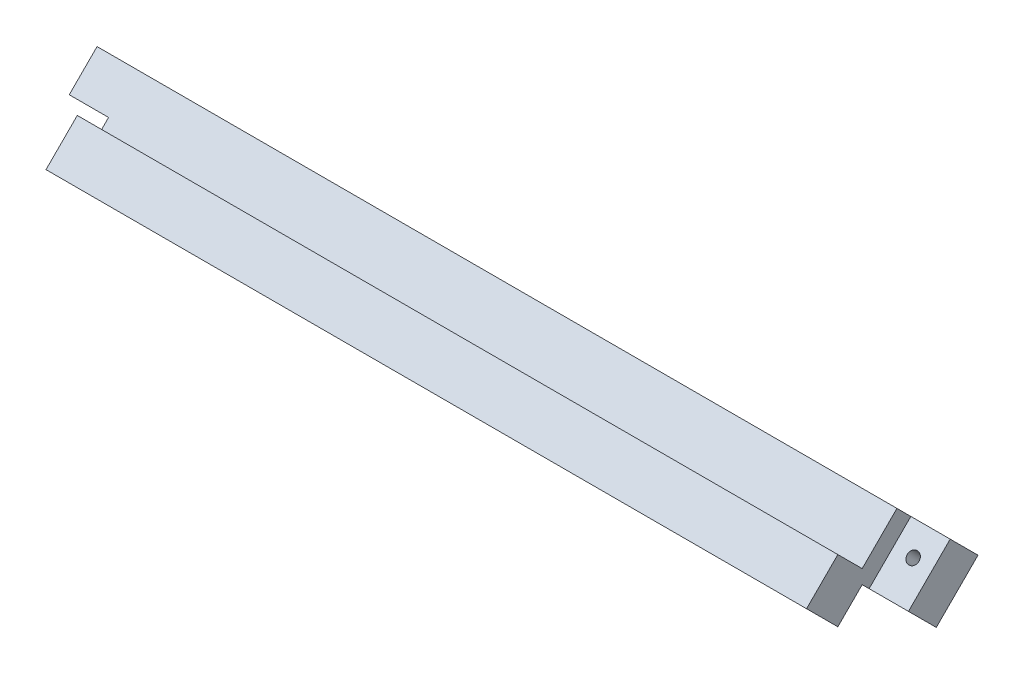
ISO-10303-21;
HEADER;
FILE_DESCRIPTION(('STEP AP214'),'2;1');
FILE_NAME('part.step','',(''),(''),'','','');
FILE_SCHEMA(('AUTOMOTIVE_DESIGN { 1 0 10303 214 1 1 1 1 }'));
ENDSEC;
DATA;
#1=APPLICATION_CONTEXT('core data for automotive mechanical design processes');
#2=APPLICATION_PROTOCOL_DEFINITION('international standard','automotive_design',2000,#1);
#3=PRODUCT_CONTEXT('',#1,'mechanical');
#4=PRODUCT('Part','Part','',(#3));
#5=PRODUCT_RELATED_PRODUCT_CATEGORY('part','',(#4));
#6=PRODUCT_DEFINITION_FORMATION('','',#4);
#7=PRODUCT_DEFINITION_CONTEXT('part definition',#1,'design');
#8=PRODUCT_DEFINITION('design','',#6,#7);
#9=PRODUCT_DEFINITION_SHAPE('','',#8);
#10=(LENGTH_UNIT() NAMED_UNIT(*) SI_UNIT(.MILLI.,.METRE.));
#11=(NAMED_UNIT(*) PLANE_ANGLE_UNIT() SI_UNIT($,.RADIAN.));
#12=(NAMED_UNIT(*) SI_UNIT($,.STERADIAN.) SOLID_ANGLE_UNIT());
#13=UNCERTAINTY_MEASURE_WITH_UNIT(LENGTH_MEASURE(1.E-05),#10,'distance_accuracy_value','');
#14=(GEOMETRIC_REPRESENTATION_CONTEXT(3) GLOBAL_UNCERTAINTY_ASSIGNED_CONTEXT((#13)) GLOBAL_UNIT_ASSIGNED_CONTEXT((#10,
#11,#12)) REPRESENTATION_CONTEXT('',''));
#15=CARTESIAN_POINT('',(0.,0.,0.));
#16=DIRECTION('',(0.,0.,1.));
#17=DIRECTION('',(1.,0.,0.));
#18=AXIS2_PLACEMENT_3D('',#15,#16,#17);
#19=CARTESIAN_POINT('',(18.3525903053945,0.70710653440504,148.07505855594));
#20=DIRECTION('',(0.,-0.707106781186555,0.70710678118654));
#21=DIRECTION('',(0.,-0.70710678118654,-0.707106781186555));
#22=AXIS2_PLACEMENT_3D('',#19,#20,#21);
#23=PLANE('',#22);
#24=DIRECTION('',(-1.,0.,0.));
#25=VECTOR('',#24,1.);
#26=CARTESIAN_POINT('',(0.,4.24264046367202,151.610592485207));
#27=LINE('',#26,#25);
#28=CARTESIAN_POINT('',(99.950878204,4.24264046367306,151.610592485207));
#29=VERTEX_POINT('',#28);
#30=CARTESIAN_POINT('',(18.6065903053946,4.24264046367222,151.610592485207));
#31=VERTEX_POINT('',#30);
#32=EDGE_CURVE('E269',#29,#31,#27,.T.);
#33=ORIENTED_EDGE('',*,*,#32,.F.);
#34=DIRECTION('',(0.,-0.70710678118654,-0.707106781186555));
#35=VECTOR('',#34,1.);
#36=CARTESIAN_POINT('',(99.950878204,0.707106534405765,148.07505855594));
#37=LINE('',#36,#35);
#38=CARTESIAN_POINT('',(99.950878204,2.82842690130084,150.196378922835));
#39=VERTEX_POINT('',#38);
#40=EDGE_CURVE('E11',#29,#39,#37,.T.);
#41=ORIENTED_EDGE('',*,*,#40,.T.);
#42=DIRECTION('',(1.,0.,0.));
#43=VECTOR('',#42,1.);
#44=CARTESIAN_POINT('',(18.3525903053945,2.82842690130012,150.196378922835));
#45=LINE('',#44,#43);
#46=CARTESIAN_POINT('',(103.950878204,2.82842690130086,150.196378922835));
#47=VERTEX_POINT('',#46);
#48=EDGE_CURVE('E202',#39,#47,#45,.T.);
#49=ORIENTED_EDGE('',*,*,#48,.T.);
#50=DIRECTION('',(0.,0.70710678118654,0.707106781186555));
#51=VECTOR('',#50,1.);
#52=CARTESIAN_POINT('',(103.950878204,0.707106534405495,148.075058555939));
#53=LINE('',#52,#51);
#54=CARTESIAN_POINT('',(103.950878204,0.,147.367952021532));
#55=VERTEX_POINT('',#54);
#56=EDGE_CURVE('E268',#55,#47,#53,.T.);
#57=ORIENTED_EDGE('',*,*,#56,.F.);
#58=DIRECTION('',(-1.,0.,0.));
#59=VECTOR('',#58,1.);
#60=CARTESIAN_POINT('',(103.950878204,0.,147.367952021532));
#61=LINE('',#60,#59);
#62=CARTESIAN_POINT('',(18.6065903053946,0.,147.367952021532));
#63=VERTEX_POINT('',#62);
#64=EDGE_CURVE('E255',#55,#63,#61,.T.);
#65=ORIENTED_EDGE('',*,*,#64,.T.);
#66=DIRECTION('',(0.,0.70710678118654,0.707106781186555));
#67=VECTOR('',#66,1.);
#68=CARTESIAN_POINT('',(18.6065903053946,0.707106534405041,148.07505855594));
#69=LINE('',#68,#67);
#70=EDGE_CURVE('E261',#63,#31,#69,.T.);
#71=ORIENTED_EDGE('',*,*,#70,.T.);
#72=EDGE_LOOP('',(#33,#41,#49,#57,#65,#71));
#73=FACE_BOUND('',#72,.T.);
#74=CARTESIAN_POINT('',(20.6065903053938,1.76776691973103,149.135718941266));
#75=DIRECTION('',(0.,-0.707106781186555,0.70710678118654));
#76=DIRECTION('',(0.,-0.70710678118654,-0.707106781186555));
#77=AXIS2_PLACEMENT_3D('',#74,#75,#76);
#78=CIRCLE('',#77,0.600000000000003);
#79=CARTESIAN_POINT('',(20.6065903053938,1.34350285101911,148.711454872554));
#80=VERTEX_POINT('',#79);
#81=EDGE_CURVE('E225',#80,#80,#78,.T.);
#82=ORIENTED_EDGE('',*,*,#81,.T.);
#83=EDGE_LOOP('',(#82));
#84=FACE_BOUND('',#83,.T.);
#85=DIRECTION('',(1.,0.,0.));
#86=VECTOR('',#85,1.);
#87=CARTESIAN_POINT('',(57.878576524557,0.460525954925448,147.82847797646));
#88=LINE('',#87,#86);
#89=CARTESIAN_POINT('',(57.878576524557,0.460525954925433,147.82847797646));
#90=VERTEX_POINT('',#89);
#91=CARTESIAN_POINT('',(58.529858575839,0.460525954925448,147.82847797646));
#92=VERTEX_POINT('',#91);
#93=EDGE_CURVE('E55',#90,#92,#88,.T.);
#94=ORIENTED_EDGE('',*,*,#93,.T.);
#95=DIRECTION('',(0.,0.70710678118654,0.707106781186555));
#96=VECTOR('',#95,1.);
#97=CARTESIAN_POINT('',(58.529858575839,0.460525954925448,147.82847797646));
#98=LINE('',#97,#96);
#99=CARTESIAN_POINT('',(58.529858575839,3.22368168448516,150.591633706019));
#100=VERTEX_POINT('',#99);
#101=EDGE_CURVE('E186',#92,#100,#98,.T.);
#102=ORIENTED_EDGE('',*,*,#101,.T.);
#103=DIRECTION('',(-0.889933250556876,-0.322504891089479,-0.322504891089478));
#104=VECTOR('',#103,1.);
#105=CARTESIAN_POINT('',(58.529858575839,3.22368168448516,150.591633706019));
#106=LINE('',#105,#104);
#107=CARTESIAN_POINT('',(52.0170380630185,0.863486165486205,148.23143818702));
#108=VERTEX_POINT('',#107);
#109=EDGE_CURVE('E398',#100,#108,#106,.T.);
#110=ORIENTED_EDGE('',*,*,#109,.T.);
#111=DIRECTION('',(0.482179429384521,-0.619476794512279,-0.619476794512279));
#112=VECTOR('',#111,1.);
#113=CARTESIAN_POINT('',(52.0170380630185,0.863486165486205,148.23143818702));
#114=LINE('',#113,#112);
#115=CARTESIAN_POINT('',(52.2879815726339,0.515393305024092,147.883345326558));
#116=VERTEX_POINT('',#115);
#117=EDGE_CURVE('E405',#108,#116,#114,.T.);
#118=ORIENTED_EDGE('',*,*,#117,.T.);
#119=DIRECTION('',(0.889887017756644,0.32256867147027,0.322568671470265));
#120=VECTOR('',#119,1.);
#121=CARTESIAN_POINT('',(52.2879815726339,0.515393305024092,147.883345326558));
#122=LINE('',#121,#120);
#123=CARTESIAN_POINT('',(57.878576524557,2.54188739965239,149.909839421187));
#124=VERTEX_POINT('',#123);
#125=EDGE_CURVE('E408',#116,#124,#122,.T.);
#126=ORIENTED_EDGE('',*,*,#125,.T.);
#127=DIRECTION('',(0.,-0.70710678118654,-0.707106781186555));
#128=VECTOR('',#127,1.);
#129=CARTESIAN_POINT('',(57.878576524557,2.54188739965239,149.909839421187));
#130=LINE('',#129,#128);
#131=EDGE_CURVE('E182',#124,#90,#130,.T.);
#132=ORIENTED_EDGE('',*,*,#131,.T.);
#133=EDGE_LOOP('',(#94,#102,#110,#118,#126,#132));
#134=FACE_BOUND('',#133,.T.);
#135=ADVANCED_FACE('F40',(#73,#84,#134),#23,.F.);
#136=CARTESIAN_POINT('',(18.6065903053946,0.,160.802980575578));
#137=DIRECTION('',(1.,0.,0.));
#138=DIRECTION('',(0.,0.,-1.));
#139=AXIS2_PLACEMENT_3D('',#136,#137,#138);
#140=PLANE('',#139);
#141=DIRECTION('',(0.,0.707106781186555,-0.70710678118654));
#142=VECTOR('',#141,1.);
#143=CARTESIAN_POINT('',(18.6065903053946,-0.707106534407168,148.075058555939));
#144=LINE('',#143,#142);
#145=CARTESIAN_POINT('',(18.6065903053946,-2.82842690130179,150.196378922834));
#146=VERTEX_POINT('',#145);
#147=EDGE_CURVE('E259',#146,#63,#144,.T.);
#148=ORIENTED_EDGE('',*,*,#147,.F.);
#149=DIRECTION('',(0.,0.70710678118654,0.707106781186555));
#150=VECTOR('',#149,1.);
#151=CARTESIAN_POINT('',(18.6065903053946,-4.94974713313973,148.075058690996));
#152=LINE('',#151,#150);
#153=CARTESIAN_POINT('',(18.6065903053946,1.41421356237176,154.439019386507));
#154=VERTEX_POINT('',#153);
#155=EDGE_CURVE('E233',#146,#154,#152,.T.);
#156=ORIENTED_EDGE('',*,*,#155,.T.);
#157=DIRECTION('',(0.,-0.707106781186555,0.70710678118654));
#158=VECTOR('',#157,1.);
#159=CARTESIAN_POINT('',(18.6065903053946,77.9266164744395,77.9266164744411));
#160=LINE('',#159,#158);
#161=EDGE_CURVE('E258',#31,#154,#160,.T.);
#162=ORIENTED_EDGE('',*,*,#161,.F.);
#163=ORIENTED_EDGE('',*,*,#70,.F.);
#164=EDGE_LOOP('',(#148,#156,#162,#163));
#165=FACE_BOUND('',#164,.T.);
#166=ADVANCED_FACE('F313',(#165),#140,.F.);
#167=CARTESIAN_POINT('',(7.94035660287711E-13,-77.926616474441,77.9266164744393));
#168=DIRECTION('',(0.,0.707106781186555,-0.70710678118654));
#169=DIRECTION('',(0.,0.70710678118654,0.707106781186555));
#170=AXIS2_PLACEMENT_3D('',#167,#168,#169);
#171=PLANE('',#170);
#172=DIRECTION('',(-1.,0.,0.));
#173=VECTOR('',#172,1.);
#174=CARTESIAN_POINT('',(2.63124214147878E-13,-1.41421356237355,154.439019386508));
#175=LINE('',#174,#173);
#176=CARTESIAN_POINT('',(103.950878204,-1.41421356237268,154.439019386508));
#177=VERTEX_POINT('',#176);
#178=CARTESIAN_POINT('',(99.9508782040001,-1.41421356237268,154.439019386508));
#179=VERTEX_POINT('',#178);
#180=EDGE_CURVE('E63',#177,#179,#175,.T.);
#181=ORIENTED_EDGE('',*,*,#180,.T.);
#182=DIRECTION('',(0.,0.70710678118654,0.707106781186555));
#183=VECTOR('',#182,1.);
#184=CARTESIAN_POINT('',(99.9508782040006,-77.9266164744401,77.9266164744392));
#185=LINE('',#184,#183);
#186=CARTESIAN_POINT('',(99.9508782040001,-0.70710662420936,155.146126324672));
#187=VERTEX_POINT('',#186);
#188=EDGE_CURVE('E219',#179,#187,#185,.T.);
#189=ORIENTED_EDGE('',*,*,#188,.T.);
#190=DIRECTION('',(-1.,0.,0.));
#191=VECTOR('',#190,1.);
#192=CARTESIAN_POINT('',(109.20487811,-0.707106624209291,155.146126324672));
#193=LINE('',#192,#191);
#194=CARTESIAN_POINT('',(22.6065903053946,-0.707106624210203,155.146126324672));
#195=VERTEX_POINT('',#194);
#196=EDGE_CURVE('E282',#187,#195,#193,.T.);
#197=ORIENTED_EDGE('',*,*,#196,.T.);
#198=DIRECTION('',(0.,-0.70710678118654,-0.707106781186555));
#199=VECTOR('',#198,1.);
#200=CARTESIAN_POINT('',(22.6065903053954,-77.9266164744407,77.9266164744393));
#201=LINE('',#200,#199);
#202=CARTESIAN_POINT('',(22.6065903053946,-4.24264046367491,151.610592485207));
#203=VERTEX_POINT('',#202);
#204=EDGE_CURVE('E246',#195,#203,#201,.T.);
#205=ORIENTED_EDGE('',*,*,#204,.T.);
#206=DIRECTION('',(1.,0.,0.));
#207=VECTOR('',#206,1.);
#208=CARTESIAN_POINT('',(0.,-4.24264046367513,151.610592485207));
#209=LINE('',#208,#207);
#210=CARTESIAN_POINT('',(103.950878204,-4.24264046367404,151.610592485207));
#211=VERTEX_POINT('',#210);
#212=EDGE_CURVE('E276',#203,#211,#209,.T.);
#213=ORIENTED_EDGE('',*,*,#212,.T.);
#214=DIRECTION('',(0.,-0.70710678118654,-0.707106781186555));
#215=VECTOR('',#214,1.);
#216=CARTESIAN_POINT('',(103.950878204,-77.9266164744405,77.9266164744388));
#217=LINE('',#216,#215);
#218=EDGE_CURVE('E272',#177,#211,#217,.T.);
#219=ORIENTED_EDGE('',*,*,#218,.F.);
#220=EDGE_LOOP('',(#181,#189,#197,#205,#213,#219));
#221=FACE_BOUND('',#220,.T.);
#222=ADVANCED_FACE('F337',(#221),#171,.F.);
#223=CARTESIAN_POINT('',(104.204878204,-0.707106534406705,148.07505855594));
#224=DIRECTION('',(0.,0.70710678118654,0.707106781186555));
#225=DIRECTION('',(0.,-0.707106781186555,0.70710678118654));
#226=AXIS2_PLACEMENT_3D('',#223,#224,#225);
#227=PLANE('',#226);
#228=CARTESIAN_POINT('',(101.950878204001,-1.76776691973194,149.135718941265));
#229=DIRECTION('',(0.,0.70710678118654,0.707106781186555));
#230=DIRECTION('',(0.,-0.707106781186555,0.70710678118654));
#231=AXIS2_PLACEMENT_3D('',#228,#229,#230);
#232=CIRCLE('',#231,0.600000000000003);
#233=CARTESIAN_POINT('',(101.950878204001,-2.19203098844388,149.559983009977));
#234=VERTEX_POINT('',#233);
#235=EDGE_CURVE('E191',#234,#234,#232,.T.);
#236=ORIENTED_EDGE('',*,*,#235,.T.);
#237=EDGE_LOOP('',(#236));
#238=FACE_BOUND('',#237,.T.);
#239=ORIENTED_EDGE('',*,*,#212,.F.);
#240=DIRECTION('',(0.,0.707106781186555,-0.70710678118654));
#241=VECTOR('',#240,1.);
#242=CARTESIAN_POINT('',(22.6065903053946,-0.707106534407437,148.075058555939));
#243=LINE('',#242,#241);
#244=CARTESIAN_POINT('',(22.6065903053946,-2.82842690130178,150.196378922834));
#245=VERTEX_POINT('',#244);
#246=EDGE_CURVE('E249',#203,#245,#243,.T.);
#247=ORIENTED_EDGE('',*,*,#246,.T.);
#248=DIRECTION('',(-1.,0.,0.));
#249=VECTOR('',#248,1.);
#250=CARTESIAN_POINT('',(104.204878204,-2.82842690130104,150.196378922834));
#251=LINE('',#250,#249);
#252=EDGE_CURVE('E252',#245,#146,#251,.T.);
#253=ORIENTED_EDGE('',*,*,#252,.T.);
#254=ORIENTED_EDGE('',*,*,#147,.T.);
#255=ORIENTED_EDGE('',*,*,#64,.F.);
#256=DIRECTION('',(0.,0.707106781186555,-0.70710678118654));
#257=VECTOR('',#256,1.);
#258=CARTESIAN_POINT('',(103.950878204,-0.707106534406707,148.07505855594));
#259=LINE('',#258,#257);
#260=EDGE_CURVE('E265',#211,#55,#259,.T.);
#261=ORIENTED_EDGE('',*,*,#260,.F.);
#262=EDGE_LOOP('',(#239,#247,#253,#254,#255,#261));
#263=FACE_BOUND('',#262,.T.);
#264=ADVANCED_FACE('F308',(#238,#263),#227,.F.);
#265=CARTESIAN_POINT('',(113.704878,0.,160.802980575578));
#266=DIRECTION('',(0.,0.707106781186548,-0.707106781186548));
#267=DIRECTION('',(0.,0.707106781186548,0.707106781186548));
#268=AXIS2_PLACEMENT_3D('',#265,#266,#267);
#269=PLANE('',#268);
#270=DIRECTION('',(1.,0.,0.));
#271=VECTOR('',#270,1.);
#272=CARTESIAN_POINT('',(113.704878,-3.18198043755797,157.62100013802));
#273=LINE('',#272,#271);
#274=CARTESIAN_POINT('',(22.6065903053946,-3.18198043755847,157.62100013802));
#275=VERTEX_POINT('',#274);
#276=CARTESIAN_POINT('',(99.9508782040001,-3.18198043755807,157.62100013802));
#277=VERTEX_POINT('',#276);
#278=EDGE_CURVE('E279',#275,#277,#273,.T.);
#279=ORIENTED_EDGE('',*,*,#278,.T.);
#280=DIRECTION('',(0.,0.707106781186548,0.707106781186548));
#281=VECTOR('',#280,1.);
#282=CARTESIAN_POINT('',(99.9508782040001,0.,160.802980575578));
#283=LINE('',#282,#281);
#284=CARTESIAN_POINT('',(99.9508782040001,0.,160.802980575578));
#285=VERTEX_POINT('',#284);
#286=EDGE_CURVE('E216',#277,#285,#283,.T.);
#287=ORIENTED_EDGE('',*,*,#286,.T.);
#288=DIRECTION('',(-1.,0.,0.));
#289=VECTOR('',#288,1.);
#290=CARTESIAN_POINT('',(113.704878,0.,160.802980575578));
#291=LINE('',#290,#289);
#292=CARTESIAN_POINT('',(22.6065903053946,0.,160.802980575578));
#293=VERTEX_POINT('',#292);
#294=EDGE_CURVE('E280',#285,#293,#291,.T.);
#295=ORIENTED_EDGE('',*,*,#294,.T.);
#296=DIRECTION('',(0.,0.70710678118654,0.707106781186555));
#297=VECTOR('',#296,1.);
#298=CARTESIAN_POINT('',(22.6065903053947,-8.83883450886105,151.964146066717));
#299=LINE('',#298,#297);
#300=EDGE_CURVE('E229',#275,#293,#299,.T.);
#301=ORIENTED_EDGE('',*,*,#300,.F.);
#302=EDGE_LOOP('',(#279,#287,#295,#301));
#303=FACE_BOUND('',#302,.T.);
#304=ADVANCED_FACE('F42',(#303),#269,.F.);
#305=CARTESIAN_POINT('',(109.20487811,-0.707106624209291,155.146126324672));
#306=DIRECTION('',(0.,0.70710678118654,0.707106781186555));
#307=DIRECTION('',(0.,-0.707106781186555,0.70710678118654));
#308=AXIS2_PLACEMENT_3D('',#305,#306,#307);
#309=PLANE('',#308);
#310=ORIENTED_EDGE('',*,*,#196,.F.);
#311=DIRECTION('',(0.,-0.707106781186555,0.70710678118654));
#312=VECTOR('',#311,1.);
#313=CARTESIAN_POINT('',(99.9508782040001,-0.707106624209389,155.146126324672));
#314=LINE('',#313,#312);
#315=EDGE_CURVE('E213',#187,#277,#314,.T.);
#316=ORIENTED_EDGE('',*,*,#315,.T.);
#317=ORIENTED_EDGE('',*,*,#278,.F.);
#318=DIRECTION('',(0.,0.707106781186555,-0.70710678118654));
#319=VECTOR('',#318,1.);
#320=CARTESIAN_POINT('',(22.6065903053946,-0.707106624210065,155.146126324671));
#321=LINE('',#320,#319);
#322=EDGE_CURVE('E243',#275,#195,#321,.T.);
#323=ORIENTED_EDGE('',*,*,#322,.T.);
#324=EDGE_LOOP('',(#310,#316,#317,#323));
#325=FACE_BOUND('',#324,.T.);
#326=ADVANCED_FACE('F335',(#325),#309,.F.);
#327=CARTESIAN_POINT('',(113.704878,0.,160.802980575578));
#328=DIRECTION('',(0.,-0.707106781186548,-0.707106781186548));
#329=DIRECTION('',(0.,0.707106781186548,-0.707106781186548));
#330=AXIS2_PLACEMENT_3D('',#327,#328,#329);
#331=PLANE('',#330);
#332=ORIENTED_EDGE('',*,*,#294,.F.);
#333=DIRECTION('',(0.,-0.70710678118654,0.707106781186555));
#334=VECTOR('',#333,1.);
#335=CARTESIAN_POINT('',(99.950878204,8.83883450886015,151.964146066718));
#336=LINE('',#335,#334);
#337=CARTESIAN_POINT('',(99.950878204,3.18198043755745,157.621000138021));
#338=VERTEX_POINT('',#337);
#339=EDGE_CURVE('E200',#338,#285,#336,.T.);
#340=ORIENTED_EDGE('',*,*,#339,.F.);
#341=DIRECTION('',(-1.,0.,0.));
#342=VECTOR('',#341,1.);
#343=CARTESIAN_POINT('',(113.704878,3.18198043755753,157.621000138021));
#344=LINE('',#343,#342);
#345=CARTESIAN_POINT('',(22.6065903053946,3.18198043755705,157.621000138021));
#346=VERTEX_POINT('',#345);
#347=EDGE_CURVE('E277',#338,#346,#344,.T.);
#348=ORIENTED_EDGE('',*,*,#347,.T.);
#349=DIRECTION('',(0.,-0.707106781186548,0.707106781186548));
#350=VECTOR('',#349,1.);
#351=CARTESIAN_POINT('',(22.6065903053946,-3.26580183979087E-13,160.802980575579));
#352=LINE('',#351,#350);
#353=EDGE_CURVE('E240',#346,#293,#352,.T.);
#354=ORIENTED_EDGE('',*,*,#353,.T.);
#355=EDGE_LOOP('',(#332,#340,#348,#354));
#356=FACE_BOUND('',#355,.T.);
#357=ADVANCED_FACE('F326',(#356),#331,.F.);
#358=CARTESIAN_POINT('',(-8.16237981659082E-13,77.9266164744394,77.926616474441));
#359=DIRECTION('',(0.,-0.70710678118654,-0.707106781186555));
#360=DIRECTION('',(0.,0.707106781186555,-0.70710678118654));
#361=AXIS2_PLACEMENT_3D('',#358,#359,#360);
#362=PLANE('',#361);
#363=DIRECTION('',(1.,0.,0.));
#364=VECTOR('',#363,1.);
#365=CARTESIAN_POINT('',(8.69333222409788,0.707106624207358,155.146126324672));
#366=LINE('',#365,#364);
#367=CARTESIAN_POINT('',(22.6065903053946,0.707106624207503,155.146126324672));
#368=VERTEX_POINT('',#367);
#369=CARTESIAN_POINT('',(99.950878204,0.707106624208337,155.146126324672));
#370=VERTEX_POINT('',#369);
#371=EDGE_CURVE('E264',#368,#370,#366,.T.);
#372=ORIENTED_EDGE('',*,*,#371,.T.);
#373=DIRECTION('',(0.,0.707106781186555,-0.70710678118654));
#374=VECTOR('',#373,1.);
#375=CARTESIAN_POINT('',(99.9508782039992,77.9266164744405,77.926616474441));
#376=LINE('',#375,#374);
#377=EDGE_CURVE('E207',#370,#29,#376,.T.);
#378=ORIENTED_EDGE('',*,*,#377,.T.);
#379=ORIENTED_EDGE('',*,*,#32,.T.);
#380=ORIENTED_EDGE('',*,*,#161,.T.);
#381=DIRECTION('',(1.,0.,0.));
#382=VECTOR('',#381,1.);
#383=CARTESIAN_POINT('',(-2.85326535519241E-13,1.41421356237159,154.439019386507));
#384=LINE('',#383,#382);
#385=CARTESIAN_POINT('',(22.6065903053946,1.41421356237177,154.439019386507));
#386=VERTEX_POINT('',#385);
#387=EDGE_CURVE('E294',#154,#386,#384,.T.);
#388=ORIENTED_EDGE('',*,*,#387,.T.);
#389=DIRECTION('',(0.,-0.707106781186555,0.70710678118654));
#390=VECTOR('',#389,1.);
#391=CARTESIAN_POINT('',(22.606590305394,77.9266164744396,77.9266164744411));
#392=LINE('',#391,#390);
#393=EDGE_CURVE('E232',#386,#368,#392,.T.);
#394=ORIENTED_EDGE('',*,*,#393,.T.);
#395=EDGE_LOOP('',(#372,#378,#379,#380,#388,#394));
#396=FACE_BOUND('',#395,.T.);
#397=ADVANCED_FACE('F315',(#396),#362,.F.);
#398=CARTESIAN_POINT('',(8.69333222409788,0.707106624207358,155.146126324672));
#399=DIRECTION('',(0.,-0.707106781186555,0.70710678118654));
#400=DIRECTION('',(0.,-0.70710678118654,-0.707106781186555));
#401=AXIS2_PLACEMENT_3D('',#398,#399,#400);
#402=PLANE('',#401);
#403=ORIENTED_EDGE('',*,*,#347,.F.);
#404=DIRECTION('',(0.,-0.70710678118654,-0.707106781186555));
#405=VECTOR('',#404,1.);
#406=CARTESIAN_POINT('',(99.950878204,0.707106624208162,155.146126324671));
#407=LINE('',#406,#405);
#408=EDGE_CURVE('E210',#338,#370,#407,.T.);
#409=ORIENTED_EDGE('',*,*,#408,.T.);
#410=ORIENTED_EDGE('',*,*,#371,.F.);
#411=DIRECTION('',(0.,0.70710678118654,0.707106781186555));
#412=VECTOR('',#411,1.);
#413=CARTESIAN_POINT('',(22.6065903053946,0.707106624207504,155.146126324672));
#414=LINE('',#413,#412);
#415=EDGE_CURVE('E274',#368,#346,#414,.T.);
#416=ORIENTED_EDGE('',*,*,#415,.T.);
#417=EDGE_LOOP('',(#403,#409,#410,#416));
#418=FACE_BOUND('',#417,.T.);
#419=ADVANCED_FACE('F322',(#418),#402,.F.);
#420=CARTESIAN_POINT('',(103.950878204,0.,160.802980575578));
#421=DIRECTION('',(1.,0.,0.));
#422=DIRECTION('',(0.,0.,-1.));
#423=AXIS2_PLACEMENT_3D('',#420,#421,#422);
#424=PLANE('',#423);
#425=DIRECTION('',(0.,0.70710678118654,-0.707106781186555));
#426=VECTOR('',#425,1.);
#427=CARTESIAN_POINT('',(103.950878204,-3.88908737572137,156.913893199857));
#428=LINE('',#427,#426);
#429=EDGE_CURVE('E48',#177,#47,#428,.T.);
#430=ORIENTED_EDGE('',*,*,#429,.F.);
#431=ORIENTED_EDGE('',*,*,#218,.T.);
#432=ORIENTED_EDGE('',*,*,#260,.T.);
#433=ORIENTED_EDGE('',*,*,#56,.T.);
#434=EDGE_LOOP('',(#430,#431,#432,#433));
#435=FACE_BOUND('',#434,.T.);
#436=ADVANCED_FACE('F303',(#435),#424,.T.);
#437=CARTESIAN_POINT('',(22.6065903053946,-4.9497471331397,148.075058690996));
#438=DIRECTION('',(0.,0.707106781186555,-0.70710678118654));
#439=DIRECTION('',(0.,0.70710678118654,0.707106781186555));
#440=AXIS2_PLACEMENT_3D('',#437,#438,#439);
#441=PLANE('',#440);
#442=CARTESIAN_POINT('',(20.6065903053938,-1.06065998156943,151.964145842566));
#443=DIRECTION('',(0.,-0.707106781186555,0.70710678118654));
#444=DIRECTION('',(0.,-0.70710678118654,-0.707106781186555));
#445=AXIS2_PLACEMENT_3D('',#442,#443,#444);
#446=CIRCLE('',#445,0.600000000000003);
#447=CARTESIAN_POINT('',(20.6065903053938,-1.48492405028135,151.539881773854));
#448=VERTEX_POINT('',#447);
#449=EDGE_CURVE('E222',#448,#448,#446,.T.);
#450=ORIENTED_EDGE('',*,*,#449,.F.);
#451=EDGE_LOOP('',(#450));
#452=FACE_BOUND('',#451,.T.);
#453=DIRECTION('',(0.,0.70710678118654,0.707106781186555));
#454=VECTOR('',#453,1.);
#455=CARTESIAN_POINT('',(22.6065903053946,-4.9497471331397,148.075058690996));
#456=LINE('',#455,#454);
#457=EDGE_CURVE('E228',#245,#386,#456,.T.);
#458=ORIENTED_EDGE('',*,*,#457,.T.);
#459=ORIENTED_EDGE('',*,*,#387,.F.);
#460=ORIENTED_EDGE('',*,*,#155,.F.);
#461=ORIENTED_EDGE('',*,*,#252,.F.);
#462=EDGE_LOOP('',(#458,#459,#460,#461));
#463=FACE_BOUND('',#462,.T.);
#464=ADVANCED_FACE('F340',(#452,#463),#441,.F.);
#465=CARTESIAN_POINT('',(22.6065903053946,-4.9497471331397,148.075058690996));
#466=DIRECTION('',(1.,0.,0.));
#467=DIRECTION('',(0.,1.,0.));
#468=AXIS2_PLACEMENT_3D('',#465,#466,#467);
#469=PLANE('',#468);
#470=ORIENTED_EDGE('',*,*,#204,.F.);
#471=ORIENTED_EDGE('',*,*,#322,.F.);
#472=ORIENTED_EDGE('',*,*,#300,.T.);
#473=ORIENTED_EDGE('',*,*,#353,.F.);
#474=ORIENTED_EDGE('',*,*,#415,.F.);
#475=ORIENTED_EDGE('',*,*,#393,.F.);
#476=ORIENTED_EDGE('',*,*,#457,.F.);
#477=ORIENTED_EDGE('',*,*,#246,.F.);
#478=EDGE_LOOP('',(#470,#471,#472,#473,#474,#475,#476,#477));
#479=FACE_BOUND('',#478,.T.);
#480=ADVANCED_FACE('F329',(#479),#469,.F.);
#481=CARTESIAN_POINT('',(20.6065903053938,3.88908715156903,147.014398709428));
#482=DIRECTION('',(0.,-0.707106781186555,0.70710678118654));
#483=DIRECTION('',(0.,-0.70710678118654,-0.707106781186555));
#484=AXIS2_PLACEMENT_3D('',#481,#482,#483);
#485=CYLINDRICAL_SURFACE('',#484,0.600000000000003);
#486=ORIENTED_EDGE('',*,*,#449,.T.);
#487=EDGE_LOOP('',(#486));
#488=FACE_BOUND('',#487,.T.);
#489=ORIENTED_EDGE('',*,*,#81,.F.);
#490=EDGE_LOOP('',(#489));
#491=FACE_BOUND('',#490,.T.);
#492=ADVANCED_FACE('F348',(#488,#491),#485,.F.);
#493=CARTESIAN_POINT('',(99.950878204,4.9497471331388,148.075058690997));
#494=DIRECTION('',(-1.,0.,0.));
#495=DIRECTION('',(0.,-1.,0.));
#496=AXIS2_PLACEMENT_3D('',#493,#494,#495);
#497=PLANE('',#496);
#498=DIRECTION('',(0.,-0.70710678118654,0.707106781186555));
#499=VECTOR('',#498,1.);
#500=CARTESIAN_POINT('',(99.950878204,4.9497471331388,148.075058690997));
#501=LINE('',#500,#499);
#502=EDGE_CURVE('E199',#39,#179,#501,.T.);
#503=ORIENTED_EDGE('',*,*,#502,.F.);
#504=ORIENTED_EDGE('',*,*,#40,.F.);
#505=ORIENTED_EDGE('',*,*,#377,.F.);
#506=ORIENTED_EDGE('',*,*,#408,.F.);
#507=ORIENTED_EDGE('',*,*,#339,.T.);
#508=ORIENTED_EDGE('',*,*,#286,.F.);
#509=ORIENTED_EDGE('',*,*,#315,.F.);
#510=ORIENTED_EDGE('',*,*,#188,.F.);
#511=EDGE_LOOP('',(#503,#504,#505,#506,#507,#508,#509,#510));
#512=FACE_BOUND('',#511,.T.);
#513=ADVANCED_FACE('F318',(#512),#497,.F.);
#514=CARTESIAN_POINT('',(99.950878204,4.9497471331388,148.075058690997));
#515=DIRECTION('',(0.,-0.707106781186555,-0.70710678118654));
#516=DIRECTION('',(0.,0.70710678118654,-0.707106781186555));
#517=AXIS2_PLACEMENT_3D('',#514,#515,#516);
#518=PLANE('',#517);
#519=CARTESIAN_POINT('',(101.950878204001,1.06065998156944,151.964145842566));
#520=DIRECTION('',(0.,0.707106781186555,0.70710678118654));
#521=DIRECTION('',(0.,0.70710678118654,-0.707106781186555));
#522=AXIS2_PLACEMENT_3D('',#519,#520,#521);
#523=CIRCLE('',#522,0.600000000000003);
#524=CARTESIAN_POINT('',(101.950878204001,1.48492405028137,151.539881773854));
#525=VERTEX_POINT('',#524);
#526=EDGE_CURVE('E187',#525,#525,#523,.T.);
#527=ORIENTED_EDGE('',*,*,#526,.F.);
#528=EDGE_LOOP('',(#527));
#529=FACE_BOUND('',#528,.T.);
#530=ORIENTED_EDGE('',*,*,#429,.T.);
#531=ORIENTED_EDGE('',*,*,#48,.F.);
#532=ORIENTED_EDGE('',*,*,#502,.T.);
#533=ORIENTED_EDGE('',*,*,#180,.F.);
#534=EDGE_LOOP('',(#530,#531,#532,#533));
#535=FACE_BOUND('',#534,.T.);
#536=ADVANCED_FACE('F296',(#529,#535),#518,.F.);
#537=CARTESIAN_POINT('',(101.950878204001,-3.88908715156992,147.014398709427));
#538=DIRECTION('',(0.,0.707106781186555,0.70710678118654));
#539=DIRECTION('',(0.,-0.70710678118654,0.707106781186555));
#540=AXIS2_PLACEMENT_3D('',#537,#538,#539);
#541=CYLINDRICAL_SURFACE('',#540,0.600000000000003);
#542=ORIENTED_EDGE('',*,*,#526,.T.);
#543=EDGE_LOOP('',(#542));
#544=FACE_BOUND('',#543,.T.);
#545=ORIENTED_EDGE('',*,*,#235,.F.);
#546=EDGE_LOOP('',(#545));
#547=FACE_BOUND('',#546,.T.);
#548=ADVANCED_FACE('F372',(#544,#547),#541,.F.);
#549=CARTESIAN_POINT('',(57.878576524557,0.177683242450826,148.111320688934));
#550=DIRECTION('',(0.,0.70710678118654,0.707106781186555));
#551=DIRECTION('',(0.,-0.707106781186555,0.70710678118654));
#552=AXIS2_PLACEMENT_3D('',#549,#550,#551);
#553=PLANE('',#552);
#554=ORIENTED_EDGE('',*,*,#93,.F.);
#555=DIRECTION('',(0.,0.707106781186555,-0.70710678118654));
#556=VECTOR('',#555,1.);
#557=CARTESIAN_POINT('',(57.878576524557,0.177683242450826,148.111320688934));
#558=LINE('',#557,#556);
#559=CARTESIAN_POINT('',(57.878576524557,0.177683242450826,148.111320688934));
#560=VERTEX_POINT('',#559);
#561=EDGE_CURVE('E181',#560,#90,#558,.T.);
#562=ORIENTED_EDGE('',*,*,#561,.F.);
#563=DIRECTION('',(1.,0.,0.));
#564=VECTOR('',#563,1.);
#565=CARTESIAN_POINT('',(57.878576524557,0.177683242450826,148.111320688934));
#566=LINE('',#565,#564);
#567=CARTESIAN_POINT('',(58.529858575839,0.177683242450826,148.111320688934));
#568=VERTEX_POINT('',#567);
#569=EDGE_CURVE('E172',#560,#568,#566,.T.);
#570=ORIENTED_EDGE('',*,*,#569,.T.);
#571=DIRECTION('',(0.,0.707106781186555,-0.70710678118654));
#572=VECTOR('',#571,1.);
#573=CARTESIAN_POINT('',(58.529858575839,0.177683242450826,148.111320688934));
#574=LINE('',#573,#572);
#575=EDGE_CURVE('E180',#568,#92,#574,.T.);
#576=ORIENTED_EDGE('',*,*,#575,.T.);
#577=EDGE_LOOP('',(#554,#562,#570,#576));
#578=FACE_BOUND('',#577,.T.);
#579=ADVANCED_FACE('F179',(#578),#553,.T.);
#580=CARTESIAN_POINT('',(58.529858575839,0.177683242450826,148.111320688934));
#581=DIRECTION('',(-1.,0.,0.));
#582=DIRECTION('',(0.,-1.,0.));
#583=AXIS2_PLACEMENT_3D('',#580,#581,#582);
#584=PLANE('',#583);
#585=ORIENTED_EDGE('',*,*,#101,.F.);
#586=ORIENTED_EDGE('',*,*,#575,.F.);
#587=DIRECTION('',(0.,0.70710678118654,0.707106781186555));
#588=VECTOR('',#587,1.);
#589=CARTESIAN_POINT('',(58.529858575839,0.177683242450826,148.111320688934));
#590=LINE('',#589,#588);
#591=CARTESIAN_POINT('',(58.529858575839,2.94083897201053,150.874476418494));
#592=VERTEX_POINT('',#591);
#593=EDGE_CURVE('E168',#568,#592,#590,.T.);
#594=ORIENTED_EDGE('',*,*,#593,.T.);
#595=DIRECTION('',(0.,0.707106781186555,-0.70710678118654));
#596=VECTOR('',#595,1.);
#597=CARTESIAN_POINT('',(58.529858575839,2.94083897201053,150.874476418494));
#598=LINE('',#597,#596);
#599=EDGE_CURVE('E188',#592,#100,#598,.T.);
#600=ORIENTED_EDGE('',*,*,#599,.T.);
#601=EDGE_LOOP('',(#585,#586,#594,#600));
#602=FACE_BOUND('',#601,.T.);
#603=ADVANCED_FACE('F184',(#602),#584,.T.);
#604=CARTESIAN_POINT('',(58.529858575839,2.94083897201053,150.874476418494));
#605=DIRECTION('',(0.456090790910398,-0.629277836272145,-0.629277836272163));
#606=DIRECTION('',(0.,0.707106781186557,-0.707106781186538));
#607=AXIS2_PLACEMENT_3D('',#604,#605,#606);
#608=PLANE('',#607);
#609=ORIENTED_EDGE('',*,*,#109,.F.);
#610=ORIENTED_EDGE('',*,*,#599,.F.);
#611=DIRECTION('',(-0.889933250556876,-0.322504891089479,-0.322504891089478));
#612=VECTOR('',#611,1.);
#613=CARTESIAN_POINT('',(58.529858575839,2.94083897201053,150.874476418494));
#614=LINE('',#613,#612);
#615=CARTESIAN_POINT('',(52.0170380630185,0.580643453011583,148.514280899495));
#616=VERTEX_POINT('',#615);
#617=EDGE_CURVE('E174',#592,#616,#614,.T.);
#618=ORIENTED_EDGE('',*,*,#617,.T.);
#619=DIRECTION('',(0.,0.707106781186555,-0.70710678118654));
#620=VECTOR('',#619,1.);
#621=CARTESIAN_POINT('',(52.0170380630185,0.580643453011583,148.514280899495));
#622=LINE('',#621,#620);
#623=EDGE_CURVE('E193',#616,#108,#622,.T.);
#624=ORIENTED_EDGE('',*,*,#623,.T.);
#625=EDGE_LOOP('',(#609,#610,#618,#624));
#626=FACE_BOUND('',#625,.T.);
#627=ADVANCED_FACE('F419',(#626),#608,.T.);
#628=CARTESIAN_POINT('',(52.0170380630185,0.580643453011583,148.514280899495));
#629=DIRECTION('',(0.876072484374677,0.340952344266456,0.340952344266453));
#630=DIRECTION('',(-0.362684168916421,0.931912116895904,0.));
#631=AXIS2_PLACEMENT_3D('',#628,#629,#630);
#632=PLANE('',#631);
#633=ORIENTED_EDGE('',*,*,#117,.F.);
#634=ORIENTED_EDGE('',*,*,#623,.F.);
#635=DIRECTION('',(0.482179429384521,-0.619476794512279,-0.619476794512279));
#636=VECTOR('',#635,1.);
#637=CARTESIAN_POINT('',(52.0170380630185,0.580643453011583,148.514280899495));
#638=LINE('',#637,#636);
#639=CARTESIAN_POINT('',(52.2879815726339,0.23255059254947,148.166188039033));
#640=VERTEX_POINT('',#639);
#641=EDGE_CURVE('E431',#616,#640,#638,.T.);
#642=ORIENTED_EDGE('',*,*,#641,.T.);
#643=DIRECTION('',(0.,0.707106781186555,-0.70710678118654));
#644=VECTOR('',#643,1.);
#645=CARTESIAN_POINT('',(52.2879815726339,0.23255059254947,148.166188039033));
#646=LINE('',#645,#644);
#647=EDGE_CURVE('E414',#640,#116,#646,.T.);
#648=ORIENTED_EDGE('',*,*,#647,.T.);
#649=EDGE_LOOP('',(#633,#634,#642,#648));
#650=FACE_BOUND('',#649,.T.);
#651=ADVANCED_FACE('F421',(#650),#632,.T.);
#652=CARTESIAN_POINT('',(52.2879815726339,0.23255059254947,148.166188039033));
#653=DIRECTION('',(-0.456180989989923,0.629245144745588,0.629245144745605));
#654=DIRECTION('',(0.,-0.707106781186557,0.707106781186538));
#655=AXIS2_PLACEMENT_3D('',#652,#653,#654);
#656=PLANE('',#655);
#657=ORIENTED_EDGE('',*,*,#125,.F.);
#658=ORIENTED_EDGE('',*,*,#647,.F.);
#659=DIRECTION('',(0.889887017756644,0.32256867147027,0.322568671470265));
#660=VECTOR('',#659,1.);
#661=CARTESIAN_POINT('',(52.2879815726339,0.23255059254947,148.166188039033));
#662=LINE('',#661,#660);
#663=CARTESIAN_POINT('',(57.878576524557,2.25904468717777,150.192682133661));
#664=VERTEX_POINT('',#663);
#665=EDGE_CURVE('E428',#640,#664,#662,.T.);
#666=ORIENTED_EDGE('',*,*,#665,.T.);
#667=DIRECTION('',(0.,0.707106781186555,-0.70710678118654));
#668=VECTOR('',#667,1.);
#669=CARTESIAN_POINT('',(57.878576524557,2.25904468717777,150.192682133661));
#670=LINE('',#669,#668);
#671=EDGE_CURVE('E412',#664,#124,#670,.T.);
#672=ORIENTED_EDGE('',*,*,#671,.T.);
#673=EDGE_LOOP('',(#657,#658,#666,#672));
#674=FACE_BOUND('',#673,.T.);
#675=ADVANCED_FACE('F425',(#674),#656,.T.);
#676=CARTESIAN_POINT('',(57.878576524557,2.25904468717777,150.192682133661));
#677=DIRECTION('',(1.,0.,0.));
#678=DIRECTION('',(0.,1.,0.));
#679=AXIS2_PLACEMENT_3D('',#676,#677,#678);
#680=PLANE('',#679);
#681=ORIENTED_EDGE('',*,*,#131,.F.);
#682=ORIENTED_EDGE('',*,*,#671,.F.);
#683=DIRECTION('',(0.,-0.70710678118654,-0.707106781186555));
#684=VECTOR('',#683,1.);
#685=CARTESIAN_POINT('',(57.878576524557,2.25904468717777,150.192682133661));
#686=LINE('',#685,#684);
#687=EDGE_CURVE('E401',#664,#560,#686,.T.);
#688=ORIENTED_EDGE('',*,*,#687,.T.);
#689=ORIENTED_EDGE('',*,*,#561,.T.);
#690=EDGE_LOOP('',(#681,#682,#688,#689));
#691=FACE_BOUND('',#690,.T.);
#692=ADVANCED_FACE('F430',(#691),#680,.T.);
#693=CARTESIAN_POINT('',(0.,-73.9668187232417,73.9668187232402));
#694=DIRECTION('',(0.,-0.707106781186555,0.70710678118654));
#695=DIRECTION('',(0.,-0.70710678118654,-0.707106781186555));
#696=AXIS2_PLACEMENT_3D('',#693,#694,#695);
#697=PLANE('',#696);
#698=ORIENTED_EDGE('',*,*,#569,.F.);
#699=ORIENTED_EDGE('',*,*,#687,.F.);
#700=ORIENTED_EDGE('',*,*,#665,.F.);
#701=ORIENTED_EDGE('',*,*,#641,.F.);
#702=ORIENTED_EDGE('',*,*,#617,.F.);
#703=ORIENTED_EDGE('',*,*,#593,.F.);
#704=EDGE_LOOP('',(#698,#699,#700,#701,#702,#703));
#705=FACE_BOUND('',#704,.T.);
#706=ADVANCED_FACE('F170',(#705),#697,.F.);
#707=CLOSED_SHELL('',(#135,#166,#222,#264,#304,#326,#357,#397,#419,#436,#464,#480,#492,#513,
#536,#548,#579,#603,#627,#651,#675,#692,#706));
#708=MANIFOLD_SOLID_BREP('B2',#707);
#709=ADVANCED_BREP_SHAPE_REPRESENTATION('',(#18,#708),#14);
#710=SHAPE_DEFINITION_REPRESENTATION(#9,#709);
ENDSEC;
END-ISO-10303-21;
